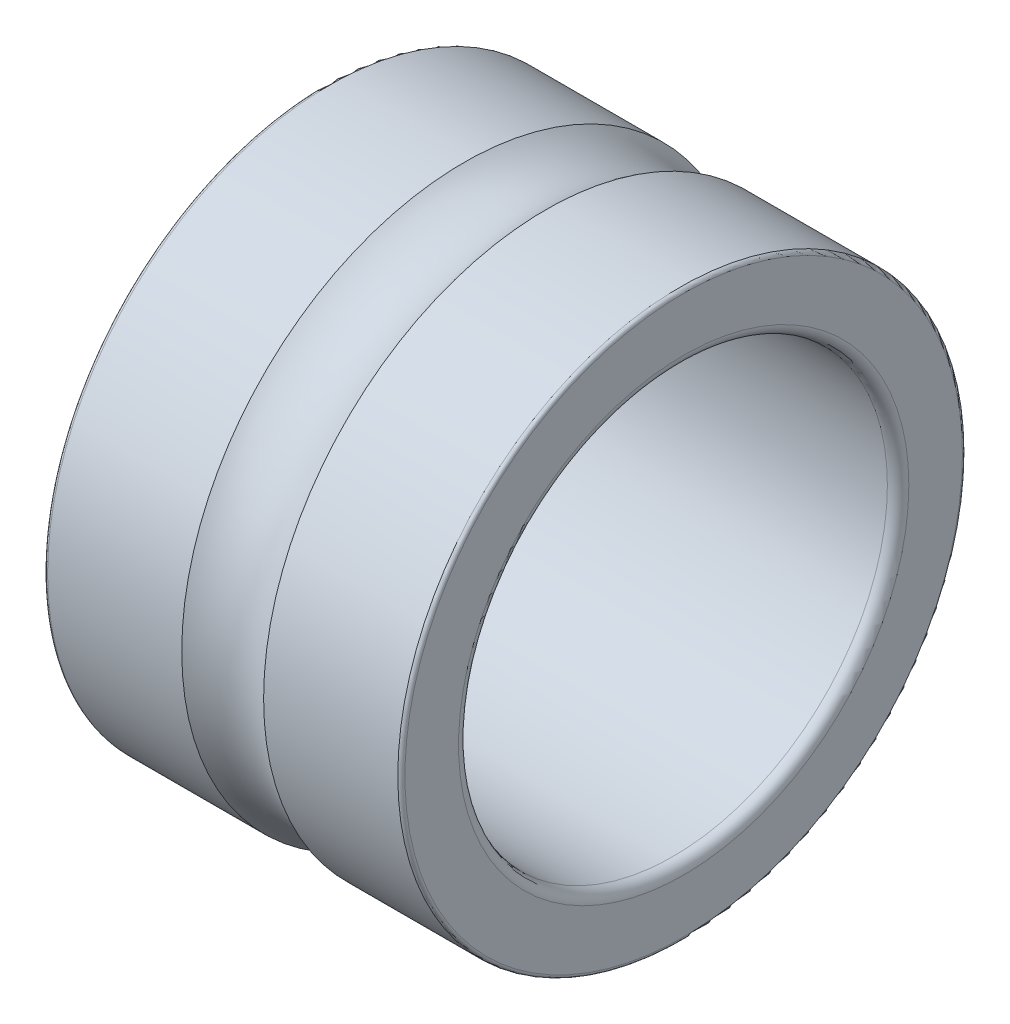
ISO-10303-21;
HEADER;
FILE_DESCRIPTION(('STEP AP214'),'2;1');
FILE_NAME('part.step','',(''),(''),'','','');
FILE_SCHEMA(('AUTOMOTIVE_DESIGN { 1 0 10303 214 1 1 1 1 }'));
ENDSEC;
DATA;
#1=APPLICATION_CONTEXT('core data for automotive mechanical design processes');
#2=APPLICATION_PROTOCOL_DEFINITION('international standard','automotive_design',2000,#1);
#3=PRODUCT_CONTEXT('',#1,'mechanical');
#4=PRODUCT('Part','Part','',(#3));
#5=PRODUCT_RELATED_PRODUCT_CATEGORY('part','',(#4));
#6=PRODUCT_DEFINITION_FORMATION('','',#4);
#7=PRODUCT_DEFINITION_CONTEXT('part definition',#1,'design');
#8=PRODUCT_DEFINITION('design','',#6,#7);
#9=PRODUCT_DEFINITION_SHAPE('','',#8);
#10=(LENGTH_UNIT() NAMED_UNIT(*) SI_UNIT(.MILLI.,.METRE.));
#11=(NAMED_UNIT(*) PLANE_ANGLE_UNIT() SI_UNIT($,.RADIAN.));
#12=(NAMED_UNIT(*) SI_UNIT($,.STERADIAN.) SOLID_ANGLE_UNIT());
#13=UNCERTAINTY_MEASURE_WITH_UNIT(LENGTH_MEASURE(1.E-05),#10,'distance_accuracy_value','');
#14=(GEOMETRIC_REPRESENTATION_CONTEXT(3) GLOBAL_UNCERTAINTY_ASSIGNED_CONTEXT((#13)) GLOBAL_UNIT_ASSIGNED_CONTEXT((#10,
#11,#12)) REPRESENTATION_CONTEXT('',''));
#15=CARTESIAN_POINT('',(0.,0.,0.));
#16=DIRECTION('',(0.,0.,1.));
#17=DIRECTION('',(1.,0.,0.));
#18=AXIS2_PLACEMENT_3D('',#15,#16,#17);
#19=CARTESIAN_POINT('',(0.0500000000000477,0.,0.));
#20=DIRECTION('',(1.,0.,0.));
#21=DIRECTION('',(0.,0.,-1.));
#22=AXIS2_PLACEMENT_3D('',#19,#20,#21);
#23=TOROIDAL_SURFACE('',#22,3.89999999999995,0.0500000000000475);
#24=CARTESIAN_POINT('',(0.,0.,0.));
#25=DIRECTION('',(1.,0.,0.));
#26=DIRECTION('',(0.,0.,-1.));
#27=AXIS2_PLACEMENT_3D('',#24,#25,#26);
#28=CIRCLE('',#27,3.9);
#29=CARTESIAN_POINT('',(0.,0.,-3.9));
#30=VERTEX_POINT('',#29);
#31=EDGE_CURVE('E10',#30,#30,#28,.T.);
#32=ORIENTED_EDGE('',*,*,#31,.T.);
#33=EDGE_LOOP('',(#32));
#34=FACE_BOUND('',#33,.T.);
#35=CARTESIAN_POINT('',(0.0499999999999997,0.,0.));
#36=DIRECTION('',(1.,0.,0.));
#37=DIRECTION('',(0.,0.,-1.));
#38=AXIS2_PLACEMENT_3D('',#35,#36,#37);
#39=CIRCLE('',#38,3.95);
#40=CARTESIAN_POINT('',(0.0499999999999997,0.,-3.95));
#41=VERTEX_POINT('',#40);
#42=EDGE_CURVE('E64',#41,#41,#39,.T.);
#43=ORIENTED_EDGE('',*,*,#42,.F.);
#44=EDGE_LOOP('',(#43));
#45=FACE_BOUND('',#44,.T.);
#46=ADVANCED_FACE('F30',(#34,#45),#23,.T.);
#47=CARTESIAN_POINT('',(0.,3.9,0.));
#48=DIRECTION('',(-1.,0.,0.));
#49=DIRECTION('',(0.,0.,1.));
#50=AXIS2_PLACEMENT_3D('',#47,#48,#49);
#51=PLANE('',#50);
#52=CARTESIAN_POINT('',(0.,0.,0.));
#53=DIRECTION('',(1.,0.,0.));
#54=DIRECTION('',(0.,0.,-1.));
#55=AXIS2_PLACEMENT_3D('',#52,#53,#54);
#56=CIRCLE('',#55,3.15);
#57=CARTESIAN_POINT('',(0.,0.,-3.15));
#58=VERTEX_POINT('',#57);
#59=EDGE_CURVE('E36',#58,#58,#56,.T.);
#60=ORIENTED_EDGE('',*,*,#59,.T.);
#61=EDGE_LOOP('',(#60));
#62=FACE_BOUND('',#61,.T.);
#63=ORIENTED_EDGE('',*,*,#31,.F.);
#64=EDGE_LOOP('',(#63));
#65=FACE_BOUND('',#64,.T.);
#66=ADVANCED_FACE('F72',(#62,#65),#51,.T.);
#67=CARTESIAN_POINT('',(0.149999999999969,0.,0.));
#68=DIRECTION('',(1.,0.,0.));
#69=DIRECTION('',(0.,0.,-1.));
#70=AXIS2_PLACEMENT_3D('',#67,#68,#69);
#71=TOROIDAL_SURFACE('',#70,3.14999999999997,0.149999999999969);
#72=CARTESIAN_POINT('',(0.15,0.,0.));
#73=DIRECTION('',(1.,0.,0.));
#74=DIRECTION('',(0.,0.,-1.));
#75=AXIS2_PLACEMENT_3D('',#72,#73,#74);
#76=CIRCLE('',#75,3.);
#77=CARTESIAN_POINT('',(0.15,0.,-3.));
#78=VERTEX_POINT('',#77);
#79=EDGE_CURVE('E40',#78,#78,#76,.T.);
#80=ORIENTED_EDGE('',*,*,#79,.T.);
#81=EDGE_LOOP('',(#80));
#82=FACE_BOUND('',#81,.T.);
#83=ORIENTED_EDGE('',*,*,#59,.F.);
#84=EDGE_LOOP('',(#83));
#85=FACE_BOUND('',#84,.T.);
#86=ADVANCED_FACE('F76',(#82,#85),#71,.T.);
#87=CARTESIAN_POINT('',(4.85,0.,0.));
#88=DIRECTION('',(1.,0.,0.));
#89=DIRECTION('',(0.,0.,-1.));
#90=AXIS2_PLACEMENT_3D('',#87,#88,#89);
#91=CYLINDRICAL_SURFACE('',#90,3.);
#92=CARTESIAN_POINT('',(4.85,0.,0.));
#93=DIRECTION('',(1.,0.,0.));
#94=DIRECTION('',(0.,0.,-1.));
#95=AXIS2_PLACEMENT_3D('',#92,#93,#94);
#96=CIRCLE('',#95,3.);
#97=CARTESIAN_POINT('',(4.85,0.,-3.));
#98=VERTEX_POINT('',#97);
#99=EDGE_CURVE('E44',#98,#98,#96,.T.);
#100=ORIENTED_EDGE('',*,*,#99,.T.);
#101=EDGE_LOOP('',(#100));
#102=FACE_BOUND('',#101,.T.);
#103=ORIENTED_EDGE('',*,*,#79,.F.);
#104=EDGE_LOOP('',(#103));
#105=FACE_BOUND('',#104,.T.);
#106=ADVANCED_FACE('F80',(#102,#105),#91,.F.);
#107=CARTESIAN_POINT('',(4.85000000000006,0.,0.));
#108=DIRECTION('',(1.,0.,0.));
#109=DIRECTION('',(0.,0.,-1.));
#110=AXIS2_PLACEMENT_3D('',#107,#108,#109);
#111=TOROIDAL_SURFACE('',#110,3.14999999999994,0.149999999999939);
#112=CARTESIAN_POINT('',(5.,0.,0.));
#113=DIRECTION('',(1.,0.,0.));
#114=DIRECTION('',(0.,0.,-1.));
#115=AXIS2_PLACEMENT_3D('',#112,#113,#114);
#116=CIRCLE('',#115,3.15);
#117=CARTESIAN_POINT('',(5.,0.,-3.15));
#118=VERTEX_POINT('',#117);
#119=EDGE_CURVE('E49',#118,#118,#116,.T.);
#120=ORIENTED_EDGE('',*,*,#119,.T.);
#121=EDGE_LOOP('',(#120));
#122=FACE_BOUND('',#121,.T.);
#123=ORIENTED_EDGE('',*,*,#99,.F.);
#124=EDGE_LOOP('',(#123));
#125=FACE_BOUND('',#124,.T.);
#126=ADVANCED_FACE('F87',(#122,#125),#111,.T.);
#127=CARTESIAN_POINT('',(5.,3.15,0.));
#128=DIRECTION('',(1.,0.,0.));
#129=DIRECTION('',(0.,0.,-1.));
#130=AXIS2_PLACEMENT_3D('',#127,#128,#129);
#131=PLANE('',#130);
#132=CARTESIAN_POINT('',(5.,0.,0.));
#133=DIRECTION('',(1.,0.,0.));
#134=DIRECTION('',(0.,0.,-1.));
#135=AXIS2_PLACEMENT_3D('',#132,#133,#134);
#136=CIRCLE('',#135,3.9);
#137=CARTESIAN_POINT('',(5.,0.,-3.9));
#138=VERTEX_POINT('',#137);
#139=EDGE_CURVE('E52',#138,#138,#136,.T.);
#140=ORIENTED_EDGE('',*,*,#139,.T.);
#141=EDGE_LOOP('',(#140));
#142=FACE_BOUND('',#141,.T.);
#143=ORIENTED_EDGE('',*,*,#119,.F.);
#144=EDGE_LOOP('',(#143));
#145=FACE_BOUND('',#144,.T.);
#146=ADVANCED_FACE('F91',(#142,#145),#131,.T.);
#147=CARTESIAN_POINT('',(4.94999999999991,0.,0.));
#148=DIRECTION('',(1.,0.,0.));
#149=DIRECTION('',(0.,0.,-1.));
#150=AXIS2_PLACEMENT_3D('',#147,#148,#149);
#151=TOROIDAL_SURFACE('',#150,3.89999999999991,0.0500000000000934);
#152=CARTESIAN_POINT('',(4.95,0.,0.));
#153=DIRECTION('',(1.,0.,0.));
#154=DIRECTION('',(0.,0.,-1.));
#155=AXIS2_PLACEMENT_3D('',#152,#153,#154);
#156=CIRCLE('',#155,3.95);
#157=CARTESIAN_POINT('',(4.95,0.,-3.95));
#158=VERTEX_POINT('',#157);
#159=EDGE_CURVE('E55',#158,#158,#156,.T.);
#160=ORIENTED_EDGE('',*,*,#159,.T.);
#161=EDGE_LOOP('',(#160));
#162=FACE_BOUND('',#161,.T.);
#163=ORIENTED_EDGE('',*,*,#139,.F.);
#164=EDGE_LOOP('',(#163));
#165=FACE_BOUND('',#164,.T.);
#166=ADVANCED_FACE('F95',(#162,#165),#151,.T.);
#167=CARTESIAN_POINT('',(4.85,0.,0.));
#168=DIRECTION('',(1.,0.,0.));
#169=DIRECTION('',(0.,0.,-1.));
#170=AXIS2_PLACEMENT_3D('',#167,#168,#169);
#171=CYLINDRICAL_SURFACE('',#170,3.95);
#172=CARTESIAN_POINT('',(3.0726814123053,0.,0.));
#173=DIRECTION('',(1.,0.,0.));
#174=DIRECTION('',(0.,0.,-1.));
#175=AXIS2_PLACEMENT_3D('',#172,#173,#174);
#176=CIRCLE('',#175,3.95);
#177=CARTESIAN_POINT('',(3.0726814123053,0.,-3.95));
#178=VERTEX_POINT('',#177);
#179=EDGE_CURVE('E58',#178,#178,#176,.T.);
#180=ORIENTED_EDGE('',*,*,#179,.T.);
#181=EDGE_LOOP('',(#180));
#182=FACE_BOUND('',#181,.T.);
#183=ORIENTED_EDGE('',*,*,#159,.F.);
#184=EDGE_LOOP('',(#183));
#185=FACE_BOUND('',#184,.T.);
#186=ADVANCED_FACE('F99',(#182,#185),#171,.T.);
#187=CARTESIAN_POINT('',(2.5,0.,0.));
#188=DIRECTION('',(1.,0.,0.));
#189=DIRECTION('',(0.,0.,-1.));
#190=AXIS2_PLACEMENT_3D('',#187,#188,#189);
#191=TOROIDAL_SURFACE('',#190,4.75999999999998,0.991999999999982);
#192=CARTESIAN_POINT('',(1.9273185876947,0.,0.));
#193=DIRECTION('',(1.,0.,0.));
#194=DIRECTION('',(0.,0.,-1.));
#195=AXIS2_PLACEMENT_3D('',#192,#193,#194);
#196=CIRCLE('',#195,3.95);
#197=CARTESIAN_POINT('',(1.9273185876947,0.,-3.95));
#198=VERTEX_POINT('',#197);
#199=EDGE_CURVE('E61',#198,#198,#196,.T.);
#200=ORIENTED_EDGE('',*,*,#199,.T.);
#201=EDGE_LOOP('',(#200));
#202=FACE_BOUND('',#201,.T.);
#203=ORIENTED_EDGE('',*,*,#179,.F.);
#204=EDGE_LOOP('',(#203));
#205=FACE_BOUND('',#204,.T.);
#206=ADVANCED_FACE('F103',(#202,#205),#191,.F.);
#207=CARTESIAN_POINT('',(4.85,0.,0.));
#208=DIRECTION('',(1.,0.,0.));
#209=DIRECTION('',(0.,0.,-1.));
#210=AXIS2_PLACEMENT_3D('',#207,#208,#209);
#211=CYLINDRICAL_SURFACE('',#210,3.95);
#212=ORIENTED_EDGE('',*,*,#42,.T.);
#213=EDGE_LOOP('',(#212));
#214=FACE_BOUND('',#213,.T.);
#215=ORIENTED_EDGE('',*,*,#199,.F.);
#216=EDGE_LOOP('',(#215));
#217=FACE_BOUND('',#216,.T.);
#218=ADVANCED_FACE('F68',(#214,#217),#211,.T.);
#219=CLOSED_SHELL('',(#46,#66,#86,#106,#126,#146,#166,#186,#206,#218));
#220=MANIFOLD_SOLID_BREP('B2',#219);
#221=ADVANCED_BREP_SHAPE_REPRESENTATION('',(#18,#220),#14);
#222=SHAPE_DEFINITION_REPRESENTATION(#9,#221);
ENDSEC;
END-ISO-10303-21;
